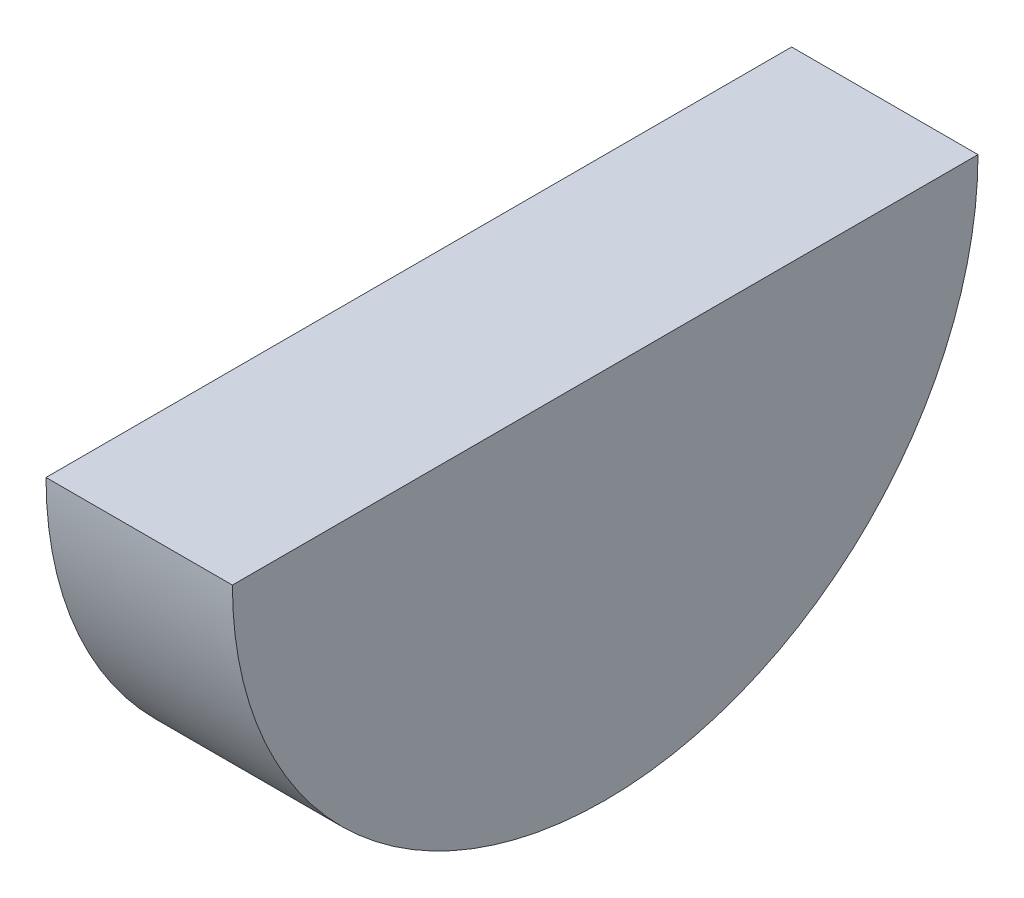
ISO-10303-21;
HEADER;
FILE_DESCRIPTION(('STEP AP214'),'2;1');
FILE_NAME('part.step','',(''),(''),'','','');
FILE_SCHEMA(('AUTOMOTIVE_DESIGN { 1 0 10303 214 1 1 1 1 }'));
ENDSEC;
DATA;
#1=APPLICATION_CONTEXT('core data for automotive mechanical design processes');
#2=APPLICATION_PROTOCOL_DEFINITION('international standard','automotive_design',2000,#1);
#3=PRODUCT_CONTEXT('',#1,'mechanical');
#4=PRODUCT('Part','Part','',(#3));
#5=PRODUCT_RELATED_PRODUCT_CATEGORY('part','',(#4));
#6=PRODUCT_DEFINITION_FORMATION('','',#4);
#7=PRODUCT_DEFINITION_CONTEXT('part definition',#1,'design');
#8=PRODUCT_DEFINITION('design','',#6,#7);
#9=PRODUCT_DEFINITION_SHAPE('','',#8);
#10=(LENGTH_UNIT() NAMED_UNIT(*) SI_UNIT(.MILLI.,.METRE.));
#11=(NAMED_UNIT(*) PLANE_ANGLE_UNIT() SI_UNIT($,.RADIAN.));
#12=(NAMED_UNIT(*) SI_UNIT($,.STERADIAN.) SOLID_ANGLE_UNIT());
#13=UNCERTAINTY_MEASURE_WITH_UNIT(LENGTH_MEASURE(1.E-05),#10,'distance_accuracy_value','');
#14=(GEOMETRIC_REPRESENTATION_CONTEXT(3) GLOBAL_UNCERTAINTY_ASSIGNED_CONTEXT((#13)) GLOBAL_UNIT_ASSIGNED_CONTEXT((#10,
#11,#12)) REPRESENTATION_CONTEXT('',''));
#15=CARTESIAN_POINT('',(0.,0.,0.));
#16=DIRECTION('',(0.,0.,1.));
#17=DIRECTION('',(1.,0.,0.));
#18=AXIS2_PLACEMENT_3D('',#15,#16,#17);
#19=CARTESIAN_POINT('',(38.1,0.,0.));
#20=DIRECTION('',(-1.,0.,0.));
#21=DIRECTION('',(0.,0.,1.));
#22=AXIS2_PLACEMENT_3D('',#19,#20,#21);
#23=CYLINDRICAL_SURFACE('',#22,76.2);
#24=CARTESIAN_POINT('',(0.,0.,0.));
#25=DIRECTION('',(1.,0.,0.));
#26=DIRECTION('',(0.,0.,-1.));
#27=AXIS2_PLACEMENT_3D('',#24,#25,#26);
#28=CIRCLE('',#27,76.2);
#29=CARTESIAN_POINT('',(0.,0.,76.2));
#30=VERTEX_POINT('',#29);
#31=CARTESIAN_POINT('',(0.,0.,-76.2));
#32=VERTEX_POINT('',#31);
#33=EDGE_CURVE('E69',#30,#32,#28,.T.);
#34=ORIENTED_EDGE('',*,*,#33,.T.);
#35=DIRECTION('',(-1.,0.,0.));
#36=VECTOR('',#35,1.);
#37=CARTESIAN_POINT('',(38.1,0.,-76.2));
#38=LINE('',#37,#36);
#39=CARTESIAN_POINT('',(38.1,0.,-76.2));
#40=VERTEX_POINT('',#39);
#41=EDGE_CURVE('E11',#40,#32,#38,.T.);
#42=ORIENTED_EDGE('',*,*,#41,.F.);
#43=CARTESIAN_POINT('',(38.1,0.,0.));
#44=DIRECTION('',(1.,0.,0.));
#45=DIRECTION('',(0.,0.,-1.));
#46=AXIS2_PLACEMENT_3D('',#43,#44,#45);
#47=CIRCLE('',#46,76.2);
#48=CARTESIAN_POINT('',(38.1,0.,76.2));
#49=VERTEX_POINT('',#48);
#50=EDGE_CURVE('E68',#49,#40,#47,.T.);
#51=ORIENTED_EDGE('',*,*,#50,.F.);
#52=DIRECTION('',(-1.,0.,0.));
#53=VECTOR('',#52,1.);
#54=CARTESIAN_POINT('',(38.1,0.,76.2));
#55=LINE('',#54,#53);
#56=EDGE_CURVE('E46',#49,#30,#55,.T.);
#57=ORIENTED_EDGE('',*,*,#56,.T.);
#58=EDGE_LOOP('',(#34,#42,#51,#57));
#59=FACE_BOUND('',#58,.T.);
#60=ADVANCED_FACE('F38',(#59),#23,.T.);
#61=CARTESIAN_POINT('',(38.1,0.,-76.2));
#62=DIRECTION('',(0.,-1.,0.));
#63=DIRECTION('',(0.,0.,-1.));
#64=AXIS2_PLACEMENT_3D('',#61,#62,#63);
#65=PLANE('',#64);
#66=DIRECTION('',(0.,0.,1.));
#67=VECTOR('',#66,1.);
#68=CARTESIAN_POINT('',(0.,0.,-76.2));
#69=LINE('',#68,#67);
#70=EDGE_CURVE('E61',#32,#30,#69,.T.);
#71=ORIENTED_EDGE('',*,*,#70,.T.);
#72=ORIENTED_EDGE('',*,*,#56,.F.);
#73=DIRECTION('',(0.,0.,1.));
#74=VECTOR('',#73,1.);
#75=CARTESIAN_POINT('',(38.1,0.,-76.2));
#76=LINE('',#75,#74);
#77=EDGE_CURVE('E53',#40,#49,#76,.T.);
#78=ORIENTED_EDGE('',*,*,#77,.F.);
#79=ORIENTED_EDGE('',*,*,#41,.T.);
#80=EDGE_LOOP('',(#71,#72,#78,#79));
#81=FACE_BOUND('',#80,.T.);
#82=ADVANCED_FACE('F64',(#81),#65,.F.);
#83=CARTESIAN_POINT('',(38.1,0.,0.));
#84=DIRECTION('',(1.,0.,0.));
#85=DIRECTION('',(0.,0.,-1.));
#86=AXIS2_PLACEMENT_3D('',#83,#84,#85);
#87=PLANE('',#86);
#88=ORIENTED_EDGE('',*,*,#50,.T.);
#89=ORIENTED_EDGE('',*,*,#77,.T.);
#90=EDGE_LOOP('',(#88,#89));
#91=FACE_BOUND('',#90,.T.);
#92=ADVANCED_FACE('F76',(#91),#87,.T.);
#93=CARTESIAN_POINT('',(0.,0.,0.));
#94=DIRECTION('',(1.,0.,0.));
#95=DIRECTION('',(0.,0.,-1.));
#96=AXIS2_PLACEMENT_3D('',#93,#94,#95);
#97=PLANE('',#96);
#98=ORIENTED_EDGE('',*,*,#33,.F.);
#99=ORIENTED_EDGE('',*,*,#70,.F.);
#100=EDGE_LOOP('',(#98,#99));
#101=FACE_BOUND('',#100,.T.);
#102=ADVANCED_FACE('F72',(#101),#97,.F.);
#103=CLOSED_SHELL('',(#60,#82,#92,#102));
#104=MANIFOLD_SOLID_BREP('B2',#103);
#105=ADVANCED_BREP_SHAPE_REPRESENTATION('',(#18,#104),#14);
#106=SHAPE_DEFINITION_REPRESENTATION(#9,#105);
ENDSEC;
END-ISO-10303-21;
